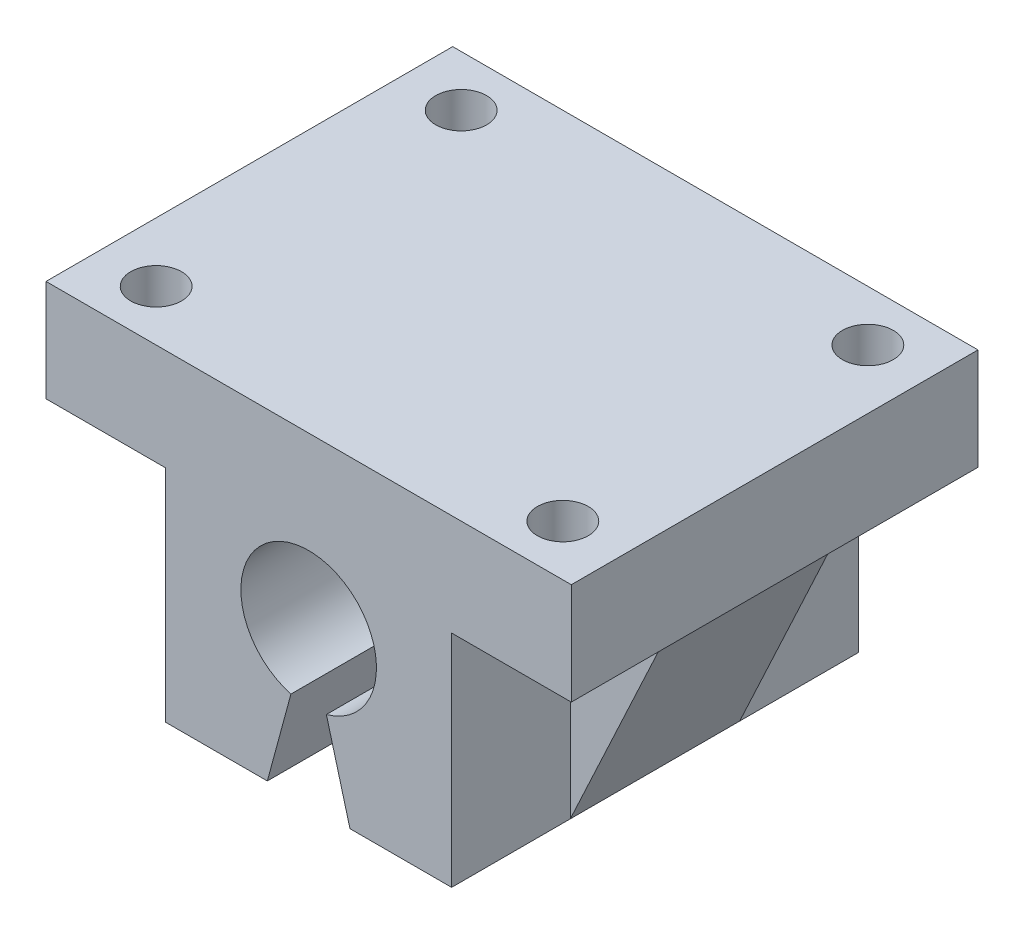
ISO-10303-21;
HEADER;
FILE_DESCRIPTION(('STEP AP214'),'2;1');
FILE_NAME('part.step','',(''),(''),'','','');
FILE_SCHEMA(('AUTOMOTIVE_DESIGN { 1 0 10303 214 1 1 1 1 }'));
ENDSEC;
DATA;
#1=APPLICATION_CONTEXT('core data for automotive mechanical design processes');
#2=APPLICATION_PROTOCOL_DEFINITION('international standard','automotive_design',2000,#1);
#3=PRODUCT_CONTEXT('',#1,'mechanical');
#4=PRODUCT('Part','Part','',(#3));
#5=PRODUCT_RELATED_PRODUCT_CATEGORY('part','',(#4));
#6=PRODUCT_DEFINITION_FORMATION('','',#4);
#7=PRODUCT_DEFINITION_CONTEXT('part definition',#1,'design');
#8=PRODUCT_DEFINITION('design','',#6,#7);
#9=PRODUCT_DEFINITION_SHAPE('','',#8);
#10=(LENGTH_UNIT() NAMED_UNIT(*) SI_UNIT(.MILLI.,.METRE.));
#11=(NAMED_UNIT(*) PLANE_ANGLE_UNIT() SI_UNIT($,.RADIAN.));
#12=(NAMED_UNIT(*) SI_UNIT($,.STERADIAN.) SOLID_ANGLE_UNIT());
#13=UNCERTAINTY_MEASURE_WITH_UNIT(LENGTH_MEASURE(1.E-05),#10,'distance_accuracy_value','');
#14=(GEOMETRIC_REPRESENTATION_CONTEXT(3) GLOBAL_UNCERTAINTY_ASSIGNED_CONTEXT((#13)) GLOBAL_UNIT_ASSIGNED_CONTEXT((#10,
#11,#12)) REPRESENTATION_CONTEXT('',''));
#15=CARTESIAN_POINT('',(0.,0.,0.));
#16=DIRECTION('',(0.,0.,1.));
#17=DIRECTION('',(1.,0.,0.));
#18=AXIS2_PLACEMENT_3D('',#15,#16,#17);
#19=CARTESIAN_POINT('',(0.,-6.,12.));
#20=DIRECTION('',(0.,1.,0.));
#21=DIRECTION('',(0.,0.,1.));
#22=AXIS2_PLACEMENT_3D('',#19,#20,#21);
#23=PLANE('',#22);
#24=CARTESIAN_POINT('',(-12.,-6.,9.));
#25=DIRECTION('',(0.,1.,0.));
#26=DIRECTION('',(0.,0.,1.));
#27=AXIS2_PLACEMENT_3D('',#24,#25,#26);
#28=CIRCLE('',#27,1.5);
#29=CARTESIAN_POINT('',(-12.,-6.,10.5));
#30=VERTEX_POINT('',#29);
#31=EDGE_CURVE('E580',#30,#30,#28,.F.);
#32=ORIENTED_EDGE('',*,*,#31,.F.);
#33=EDGE_LOOP('',(#32));
#34=FACE_BOUND('',#33,.T.);
#35=CARTESIAN_POINT('',(-12.,-6.,-9.));
#36=DIRECTION('',(0.,1.,0.));
#37=DIRECTION('',(0.,0.,1.));
#38=AXIS2_PLACEMENT_3D('',#35,#36,#37);
#39=CIRCLE('',#38,1.5);
#40=CARTESIAN_POINT('',(-12.,-6.,-7.5));
#41=VERTEX_POINT('',#40);
#42=EDGE_CURVE('E592',#41,#41,#39,.F.);
#43=ORIENTED_EDGE('',*,*,#42,.F.);
#44=EDGE_LOOP('',(#43));
#45=FACE_BOUND('',#44,.T.);
#46=DIRECTION('',(-1.,0.,0.));
#47=VECTOR('',#46,1.);
#48=CARTESIAN_POINT('',(-14.5,-6.,5.));
#49=LINE('',#48,#47);
#50=CARTESIAN_POINT('',(-8.43800044398506,-6.,5.));
#51=VERTEX_POINT('',#50);
#52=CARTESIAN_POINT('',(-14.5,-6.,5.));
#53=VERTEX_POINT('',#52);
#54=EDGE_CURVE('E170',#51,#53,#49,.T.);
#55=ORIENTED_EDGE('',*,*,#54,.F.);
#56=DIRECTION('',(0.,0.,-1.));
#57=VECTOR('',#56,1.);
#58=CARTESIAN_POINT('',(-8.43800044398506,-6.,12.));
#59=LINE('',#58,#57);
#60=CARTESIAN_POINT('',(-8.43800044398506,-6.,12.));
#61=VERTEX_POINT('',#60);
#62=EDGE_CURVE('E267',#61,#51,#59,.T.);
#63=ORIENTED_EDGE('',*,*,#62,.F.);
#64=DIRECTION('',(1.,0.,0.));
#65=VECTOR('',#64,1.);
#66=CARTESIAN_POINT('',(0.,-6.,12.));
#67=LINE('',#66,#65);
#68=CARTESIAN_POINT('',(-15.5,-6.,12.));
#69=VERTEX_POINT('',#68);
#70=EDGE_CURVE('E221',#69,#61,#67,.T.);
#71=ORIENTED_EDGE('',*,*,#70,.F.);
#72=DIRECTION('',(0.,0.,-1.));
#73=VECTOR('',#72,1.);
#74=CARTESIAN_POINT('',(-15.5,-6.,12.));
#75=LINE('',#74,#73);
#76=CARTESIAN_POINT('',(-15.5,-6.,-12.));
#77=VERTEX_POINT('',#76);
#78=EDGE_CURVE('E269',#69,#77,#75,.T.);
#79=ORIENTED_EDGE('',*,*,#78,.T.);
#80=DIRECTION('',(1.,0.,0.));
#81=VECTOR('',#80,1.);
#82=CARTESIAN_POINT('',(0.,-6.,-12.));
#83=LINE('',#82,#81);
#84=CARTESIAN_POINT('',(-8.43800044398506,-6.,-12.));
#85=VERTEX_POINT('',#84);
#86=EDGE_CURVE('E248',#77,#85,#83,.T.);
#87=ORIENTED_EDGE('',*,*,#86,.T.);
#88=CARTESIAN_POINT('',(-8.43800044398506,-6.,-5.));
#89=VERTEX_POINT('',#88);
#90=EDGE_CURVE('E266',#89,#85,#59,.T.);
#91=ORIENTED_EDGE('',*,*,#90,.F.);
#92=DIRECTION('',(-1.,0.,0.));
#93=VECTOR('',#92,1.);
#94=CARTESIAN_POINT('',(-14.5,-6.,-5.));
#95=LINE('',#94,#93);
#96=CARTESIAN_POINT('',(-14.5,-6.,-5.));
#97=VERTEX_POINT('',#96);
#98=EDGE_CURVE('E179',#89,#97,#95,.T.);
#99=ORIENTED_EDGE('',*,*,#98,.T.);
#100=DIRECTION('',(0.,0.,-1.));
#101=VECTOR('',#100,1.);
#102=CARTESIAN_POINT('',(-14.5,-6.,5.));
#103=LINE('',#102,#101);
#104=EDGE_CURVE('E163',#53,#97,#103,.T.);
#105=ORIENTED_EDGE('',*,*,#104,.F.);
#106=EDGE_LOOP('',(#55,#63,#71,#79,#87,#91,#99,#105));
#107=FACE_BOUND('',#106,.T.);
#108=ADVANCED_FACE('F34',(#34,#45,#107),#23,.F.);
#109=CARTESIAN_POINT('',(-8.43800044398506,0.,12.));
#110=DIRECTION('',(1.,0.,0.));
#111=DIRECTION('',(0.,1.,0.));
#112=AXIS2_PLACEMENT_3D('',#109,#110,#111);
#113=PLANE('',#112);
#114=DIRECTION('',(0.,1.,0.));
#115=VECTOR('',#114,1.);
#116=CARTESIAN_POINT('',(-8.43800044398506,-6.,5.));
#117=LINE('',#116,#115);
#118=CARTESIAN_POINT('',(-8.43800044398506,-19.,5.));
#119=VERTEX_POINT('',#118);
#120=EDGE_CURVE('E169',#119,#51,#117,.T.);
#121=ORIENTED_EDGE('',*,*,#120,.F.);
#122=DIRECTION('',(0.,0.,-1.));
#123=VECTOR('',#122,1.);
#124=CARTESIAN_POINT('',(-8.43800044398506,-19.,12.));
#125=LINE('',#124,#123);
#126=CARTESIAN_POINT('',(-8.43800044398506,-19.,12.));
#127=VERTEX_POINT('',#126);
#128=EDGE_CURVE('E263',#127,#119,#125,.T.);
#129=ORIENTED_EDGE('',*,*,#128,.F.);
#130=DIRECTION('',(0.,-1.,0.));
#131=VECTOR('',#130,1.);
#132=CARTESIAN_POINT('',(-8.43800044398506,0.,12.));
#133=LINE('',#132,#131);
#134=EDGE_CURVE('E223',#61,#127,#133,.T.);
#135=ORIENTED_EDGE('',*,*,#134,.F.);
#136=ORIENTED_EDGE('',*,*,#62,.T.);
#137=EDGE_LOOP('',(#121,#129,#135,#136));
#138=FACE_BOUND('',#137,.T.);
#139=ADVANCED_FACE('F370',(#138),#113,.F.);
#140=CARTESIAN_POINT('',(8.43800044398507,0.,12.));
#141=DIRECTION('',(-1.,0.,0.));
#142=DIRECTION('',(0.,0.,1.));
#143=AXIS2_PLACEMENT_3D('',#140,#141,#142);
#144=PLANE('',#143);
#145=DIRECTION('',(0.,-1.,0.));
#146=VECTOR('',#145,1.);
#147=CARTESIAN_POINT('',(8.43800044398507,-19.,5.));
#148=LINE('',#147,#146);
#149=CARTESIAN_POINT('',(8.43800044398507,-6.,5.));
#150=VERTEX_POINT('',#149);
#151=CARTESIAN_POINT('',(8.43800044398507,-19.,5.));
#152=VERTEX_POINT('',#151);
#153=EDGE_CURVE('E186',#150,#152,#148,.T.);
#154=ORIENTED_EDGE('',*,*,#153,.F.);
#155=DIRECTION('',(0.,0.,-1.));
#156=VECTOR('',#155,1.);
#157=CARTESIAN_POINT('',(8.43800044398507,-6.,12.));
#158=LINE('',#157,#156);
#159=CARTESIAN_POINT('',(8.43800044398507,-6.,12.));
#160=VERTEX_POINT('',#159);
#161=EDGE_CURVE('E282',#160,#150,#158,.T.);
#162=ORIENTED_EDGE('',*,*,#161,.F.);
#163=DIRECTION('',(0.,1.,0.));
#164=VECTOR('',#163,1.);
#165=CARTESIAN_POINT('',(8.43800044398507,0.,12.));
#166=LINE('',#165,#164);
#167=CARTESIAN_POINT('',(8.43800044398507,-19.,12.));
#168=VERTEX_POINT('',#167);
#169=EDGE_CURVE('E211',#168,#160,#166,.T.);
#170=ORIENTED_EDGE('',*,*,#169,.F.);
#171=DIRECTION('',(0.,0.,-1.));
#172=VECTOR('',#171,1.);
#173=CARTESIAN_POINT('',(8.43800044398507,-19.,12.));
#174=LINE('',#173,#172);
#175=EDGE_CURVE('E286',#168,#152,#174,.T.);
#176=ORIENTED_EDGE('',*,*,#175,.T.);
#177=EDGE_LOOP('',(#154,#162,#170,#176));
#178=FACE_BOUND('',#177,.T.);
#179=ADVANCED_FACE('F313',(#178),#144,.F.);
#180=CARTESIAN_POINT('',(0.,-6.,12.));
#181=DIRECTION('',(0.,1.,0.));
#182=DIRECTION('',(0.,0.,1.));
#183=AXIS2_PLACEMENT_3D('',#180,#181,#182);
#184=PLANE('',#183);
#185=CARTESIAN_POINT('',(12.,-6.,9.));
#186=DIRECTION('',(0.,1.,0.));
#187=DIRECTION('',(0.,0.,1.));
#188=AXIS2_PLACEMENT_3D('',#185,#186,#187);
#189=CIRCLE('',#188,1.5);
#190=CARTESIAN_POINT('',(12.,-6.,10.5));
#191=VERTEX_POINT('',#190);
#192=EDGE_CURVE('E584',#191,#191,#189,.F.);
#193=ORIENTED_EDGE('',*,*,#192,.F.);
#194=EDGE_LOOP('',(#193));
#195=FACE_BOUND('',#194,.T.);
#196=CARTESIAN_POINT('',(12.,-6.,-9.));
#197=DIRECTION('',(0.,1.,0.));
#198=DIRECTION('',(0.,0.,1.));
#199=AXIS2_PLACEMENT_3D('',#196,#197,#198);
#200=CIRCLE('',#199,1.5);
#201=CARTESIAN_POINT('',(12.,-6.,-7.5));
#202=VERTEX_POINT('',#201);
#203=EDGE_CURVE('E593',#202,#202,#200,.F.);
#204=ORIENTED_EDGE('',*,*,#203,.F.);
#205=EDGE_LOOP('',(#204));
#206=FACE_BOUND('',#205,.T.);
#207=DIRECTION('',(-1.,0.,0.));
#208=VECTOR('',#207,1.);
#209=CARTESIAN_POINT('',(8.43800044398507,-6.,5.));
#210=LINE('',#209,#208);
#211=CARTESIAN_POINT('',(14.5,-6.,5.));
#212=VERTEX_POINT('',#211);
#213=EDGE_CURVE('E192',#212,#150,#210,.T.);
#214=ORIENTED_EDGE('',*,*,#213,.F.);
#215=DIRECTION('',(0.,0.,-1.));
#216=VECTOR('',#215,1.);
#217=CARTESIAN_POINT('',(14.5,-6.,5.));
#218=LINE('',#217,#216);
#219=CARTESIAN_POINT('',(14.5,-6.,-5.));
#220=VERTEX_POINT('',#219);
#221=EDGE_CURVE('E193',#212,#220,#218,.T.);
#222=ORIENTED_EDGE('',*,*,#221,.T.);
#223=DIRECTION('',(-1.,0.,0.));
#224=VECTOR('',#223,1.);
#225=CARTESIAN_POINT('',(8.43800044398507,-6.,-5.));
#226=LINE('',#225,#224);
#227=CARTESIAN_POINT('',(8.43800044398507,-6.,-5.));
#228=VERTEX_POINT('',#227);
#229=EDGE_CURVE('E190',#220,#228,#226,.T.);
#230=ORIENTED_EDGE('',*,*,#229,.T.);
#231=CARTESIAN_POINT('',(8.43800044398507,-6.,-12.));
#232=VERTEX_POINT('',#231);
#233=EDGE_CURVE('E281',#228,#232,#158,.T.);
#234=ORIENTED_EDGE('',*,*,#233,.T.);
#235=DIRECTION('',(1.,0.,0.));
#236=VECTOR('',#235,1.);
#237=CARTESIAN_POINT('',(0.,-6.,-12.));
#238=LINE('',#237,#236);
#239=CARTESIAN_POINT('',(15.5,-5.99999999999999,-12.));
#240=VERTEX_POINT('',#239);
#241=EDGE_CURVE('E240',#232,#240,#238,.T.);
#242=ORIENTED_EDGE('',*,*,#241,.T.);
#243=DIRECTION('',(0.,0.,-1.));
#244=VECTOR('',#243,1.);
#245=CARTESIAN_POINT('',(15.5,-5.99999999999999,12.));
#246=LINE('',#245,#244);
#247=CARTESIAN_POINT('',(15.5,-5.99999999999999,12.));
#248=VERTEX_POINT('',#247);
#249=EDGE_CURVE('E278',#248,#240,#246,.T.);
#250=ORIENTED_EDGE('',*,*,#249,.F.);
#251=DIRECTION('',(1.,0.,0.));
#252=VECTOR('',#251,1.);
#253=CARTESIAN_POINT('',(0.,-6.,12.));
#254=LINE('',#253,#252);
#255=EDGE_CURVE('E213',#160,#248,#254,.T.);
#256=ORIENTED_EDGE('',*,*,#255,.F.);
#257=ORIENTED_EDGE('',*,*,#161,.T.);
#258=EDGE_LOOP('',(#214,#222,#230,#234,#242,#250,#256,#257));
#259=FACE_BOUND('',#258,.T.);
#260=ADVANCED_FACE('F354',(#195,#206,#259),#184,.F.);
#261=CARTESIAN_POINT('',(0.,-10.,12.));
#262=DIRECTION('',(0.,0.,-1.));
#263=DIRECTION('',(-1.,0.,0.));
#264=AXIS2_PLACEMENT_3D('',#261,#262,#263);
#265=CYLINDRICAL_SURFACE('',#264,4.);
#266=CARTESIAN_POINT('',(0.,-10.,-12.));
#267=DIRECTION('',(0.,0.,1.));
#268=DIRECTION('',(1.,0.,0.));
#269=AXIS2_PLACEMENT_3D('',#266,#267,#268);
#270=CIRCLE('',#269,4.);
#271=CARTESIAN_POINT('',(1.04586191274877,-13.8608513127886,-12.));
#272=VERTEX_POINT('',#271);
#273=CARTESIAN_POINT('',(-1.04586191274877,-13.8608513127886,-12.));
#274=VERTEX_POINT('',#273);
#275=EDGE_CURVE('E202',#272,#274,#270,.T.);
#276=ORIENTED_EDGE('',*,*,#275,.F.);
#277=DIRECTION('',(0.,0.,-1.));
#278=VECTOR('',#277,1.);
#279=CARTESIAN_POINT('',(1.04586191274877,-13.8608513127886,12.));
#280=LINE('',#279,#278);
#281=CARTESIAN_POINT('',(1.04586191274877,-13.8608513127886,12.));
#282=VERTEX_POINT('',#281);
#283=EDGE_CURVE('E11',#282,#272,#280,.T.);
#284=ORIENTED_EDGE('',*,*,#283,.F.);
#285=CARTESIAN_POINT('',(0.,-10.,12.));
#286=DIRECTION('',(0.,0.,1.));
#287=DIRECTION('',(1.,0.,0.));
#288=AXIS2_PLACEMENT_3D('',#285,#286,#287);
#289=CIRCLE('',#288,4.);
#290=CARTESIAN_POINT('',(-1.04586191274877,-13.8608513127886,12.));
#291=VERTEX_POINT('',#290);
#292=EDGE_CURVE('E203',#282,#291,#289,.T.);
#293=ORIENTED_EDGE('',*,*,#292,.T.);
#294=DIRECTION('',(0.,0.,-1.));
#295=VECTOR('',#294,1.);
#296=CARTESIAN_POINT('',(-1.04586191274877,-13.8608513127886,12.));
#297=LINE('',#296,#295);
#298=EDGE_CURVE('E229',#291,#274,#297,.T.);
#299=ORIENTED_EDGE('',*,*,#298,.T.);
#300=EDGE_LOOP('',(#276,#284,#293,#299));
#301=FACE_BOUND('',#300,.T.);
#302=ADVANCED_FACE('F36',(#301),#265,.F.);
#303=CARTESIAN_POINT('',(-2.52369833676981,-0.683641962836577,12.));
#304=DIRECTION('',(0.965212828197151,0.261465478187193,0.));
#305=DIRECTION('',(-0.261465478187193,0.965212828197151,0.));
#306=AXIS2_PLACEMENT_3D('',#303,#304,#305);
#307=PLANE('',#306);
#308=DIRECTION('',(0.261465478187193,-0.965212828197151,0.));
#309=VECTOR('',#308,1.);
#310=CARTESIAN_POINT('',(-2.52369833676981,-0.683641962836577,-12.));
#311=LINE('',#310,#309);
#312=CARTESIAN_POINT('',(2.43800044398507,-19.,-12.));
#313=VERTEX_POINT('',#312);
#314=EDGE_CURVE('E232',#272,#313,#311,.T.);
#315=ORIENTED_EDGE('',*,*,#314,.T.);
#316=DIRECTION('',(0.,0.,-1.));
#317=VECTOR('',#316,1.);
#318=CARTESIAN_POINT('',(2.43800044398507,-19.,12.));
#319=LINE('',#318,#317);
#320=CARTESIAN_POINT('',(2.43800044398507,-19.,12.));
#321=VERTEX_POINT('',#320);
#322=EDGE_CURVE('E42',#321,#313,#319,.T.);
#323=ORIENTED_EDGE('',*,*,#322,.F.);
#324=DIRECTION('',(0.261465478187193,-0.965212828197151,0.));
#325=VECTOR('',#324,1.);
#326=CARTESIAN_POINT('',(-2.52369833676981,-0.683641962836577,12.));
#327=LINE('',#326,#325);
#328=EDGE_CURVE('E206',#282,#321,#327,.T.);
#329=ORIENTED_EDGE('',*,*,#328,.F.);
#330=ORIENTED_EDGE('',*,*,#283,.T.);
#331=EDGE_LOOP('',(#315,#323,#329,#330));
#332=FACE_BOUND('',#331,.T.);
#333=ADVANCED_FACE('F320',(#332),#307,.F.);
#334=CARTESIAN_POINT('',(0.,-19.,12.));
#335=DIRECTION('',(0.,1.,0.));
#336=DIRECTION('',(-1.,0.,0.));
#337=AXIS2_PLACEMENT_3D('',#334,#335,#336);
#338=PLANE('',#337);
#339=DIRECTION('',(1.,0.,0.));
#340=VECTOR('',#339,1.);
#341=CARTESIAN_POINT('',(0.,-19.,-12.));
#342=LINE('',#341,#340);
#343=CARTESIAN_POINT('',(8.43800044398507,-19.,-12.));
#344=VERTEX_POINT('',#343);
#345=EDGE_CURVE('E234',#313,#344,#342,.T.);
#346=ORIENTED_EDGE('',*,*,#345,.T.);
#347=CARTESIAN_POINT('',(8.43800044398507,-19.,-5.));
#348=VERTEX_POINT('',#347);
#349=EDGE_CURVE('E285',#348,#344,#174,.T.);
#350=ORIENTED_EDGE('',*,*,#349,.F.);
#351=DIRECTION('',(0.,0.,-1.));
#352=VECTOR('',#351,1.);
#353=CARTESIAN_POINT('',(8.43800044398507,-19.,5.));
#354=LINE('',#353,#352);
#355=EDGE_CURVE('E199',#152,#348,#354,.T.);
#356=ORIENTED_EDGE('',*,*,#355,.F.);
#357=ORIENTED_EDGE('',*,*,#175,.F.);
#358=DIRECTION('',(1.,0.,0.));
#359=VECTOR('',#358,1.);
#360=CARTESIAN_POINT('',(0.,-19.,12.));
#361=LINE('',#360,#359);
#362=EDGE_CURVE('E209',#321,#168,#361,.T.);
#363=ORIENTED_EDGE('',*,*,#362,.F.);
#364=ORIENTED_EDGE('',*,*,#322,.T.);
#365=EDGE_LOOP('',(#346,#350,#356,#357,#363,#364));
#366=FACE_BOUND('',#365,.T.);
#367=ADVANCED_FACE('F293',(#366),#338,.F.);
#368=ORIENTED_EDGE('',*,*,#233,.F.);
#369=DIRECTION('',(0.,-1.,0.));
#370=VECTOR('',#369,1.);
#371=CARTESIAN_POINT('',(8.43800044398507,-19.,-5.));
#372=LINE('',#371,#370);
#373=EDGE_CURVE('E57',#228,#348,#372,.T.);
#374=ORIENTED_EDGE('',*,*,#373,.T.);
#375=ORIENTED_EDGE('',*,*,#349,.T.);
#376=DIRECTION('',(0.,1.,0.));
#377=VECTOR('',#376,1.);
#378=CARTESIAN_POINT('',(8.43800044398507,0.,-12.));
#379=LINE('',#378,#377);
#380=EDGE_CURVE('E237',#344,#232,#379,.T.);
#381=ORIENTED_EDGE('',*,*,#380,.T.);
#382=EDGE_LOOP('',(#368,#374,#375,#381));
#383=FACE_BOUND('',#382,.T.);
#384=ADVANCED_FACE('F307',(#383),#144,.F.);
#385=CARTESIAN_POINT('',(15.5,0.,12.));
#386=DIRECTION('',(-1.,0.,0.));
#387=DIRECTION('',(0.,0.,1.));
#388=AXIS2_PLACEMENT_3D('',#385,#386,#387);
#389=PLANE('',#388);
#390=DIRECTION('',(0.,1.,0.));
#391=VECTOR('',#390,1.);
#392=CARTESIAN_POINT('',(15.5,0.,-12.));
#393=LINE('',#392,#391);
#394=CARTESIAN_POINT('',(15.5,0.,-12.));
#395=VERTEX_POINT('',#394);
#396=EDGE_CURVE('E242',#240,#395,#393,.T.);
#397=ORIENTED_EDGE('',*,*,#396,.T.);
#398=DIRECTION('',(0.,0.,-1.));
#399=VECTOR('',#398,1.);
#400=CARTESIAN_POINT('',(15.5,0.,12.));
#401=LINE('',#400,#399);
#402=CARTESIAN_POINT('',(15.5,0.,12.));
#403=VERTEX_POINT('',#402);
#404=EDGE_CURVE('E275',#403,#395,#401,.T.);
#405=ORIENTED_EDGE('',*,*,#404,.F.);
#406=DIRECTION('',(0.,1.,0.));
#407=VECTOR('',#406,1.);
#408=CARTESIAN_POINT('',(15.5,0.,12.));
#409=LINE('',#408,#407);
#410=EDGE_CURVE('E215',#248,#403,#409,.T.);
#411=ORIENTED_EDGE('',*,*,#410,.F.);
#412=ORIENTED_EDGE('',*,*,#249,.T.);
#413=EDGE_LOOP('',(#397,#405,#411,#412));
#414=FACE_BOUND('',#413,.T.);
#415=ADVANCED_FACE('F350',(#414),#389,.F.);
#416=CARTESIAN_POINT('',(0.,0.,12.));
#417=DIRECTION('',(0.,-1.,0.));
#418=DIRECTION('',(0.,0.,-1.));
#419=AXIS2_PLACEMENT_3D('',#416,#417,#418);
#420=PLANE('',#419);
#421=CARTESIAN_POINT('',(-12.,0.,9.));
#422=DIRECTION('',(0.,1.,0.));
#423=DIRECTION('',(0.,0.,1.));
#424=AXIS2_PLACEMENT_3D('',#421,#422,#423);
#425=CIRCLE('',#424,1.5);
#426=CARTESIAN_POINT('',(-12.,0.,10.5));
#427=VERTEX_POINT('',#426);
#428=EDGE_CURVE('E578',#427,#427,#425,.T.);
#429=ORIENTED_EDGE('',*,*,#428,.F.);
#430=EDGE_LOOP('',(#429));
#431=FACE_BOUND('',#430,.T.);
#432=CARTESIAN_POINT('',(12.,0.,9.));
#433=DIRECTION('',(0.,1.,0.));
#434=DIRECTION('',(0.,0.,1.));
#435=AXIS2_PLACEMENT_3D('',#432,#433,#434);
#436=CIRCLE('',#435,1.5);
#437=CARTESIAN_POINT('',(12.,0.,10.5));
#438=VERTEX_POINT('',#437);
#439=EDGE_CURVE('E581',#438,#438,#436,.T.);
#440=ORIENTED_EDGE('',*,*,#439,.F.);
#441=EDGE_LOOP('',(#440));
#442=FACE_BOUND('',#441,.T.);
#443=CARTESIAN_POINT('',(12.,0.,-9.));
#444=DIRECTION('',(0.,1.,0.));
#445=DIRECTION('',(0.,0.,1.));
#446=AXIS2_PLACEMENT_3D('',#443,#444,#445);
#447=CIRCLE('',#446,1.5);
#448=CARTESIAN_POINT('',(12.,0.,-7.5));
#449=VERTEX_POINT('',#448);
#450=EDGE_CURVE('E603',#449,#449,#447,.T.);
#451=ORIENTED_EDGE('',*,*,#450,.F.);
#452=EDGE_LOOP('',(#451));
#453=FACE_BOUND('',#452,.T.);
#454=CARTESIAN_POINT('',(-12.,0.,-9.));
#455=DIRECTION('',(0.,1.,0.));
#456=DIRECTION('',(0.,0.,1.));
#457=AXIS2_PLACEMENT_3D('',#454,#455,#456);
#458=CIRCLE('',#457,1.5);
#459=CARTESIAN_POINT('',(-12.,0.,-7.5));
#460=VERTEX_POINT('',#459);
#461=EDGE_CURVE('E589',#460,#460,#458,.T.);
#462=ORIENTED_EDGE('',*,*,#461,.F.);
#463=EDGE_LOOP('',(#462));
#464=FACE_BOUND('',#463,.T.);
#465=DIRECTION('',(-1.,0.,0.));
#466=VECTOR('',#465,1.);
#467=CARTESIAN_POINT('',(0.,0.,-12.));
#468=LINE('',#467,#466);
#469=CARTESIAN_POINT('',(-15.5,0.,-12.));
#470=VERTEX_POINT('',#469);
#471=EDGE_CURVE('E244',#395,#470,#468,.T.);
#472=ORIENTED_EDGE('',*,*,#471,.T.);
#473=DIRECTION('',(0.,0.,-1.));
#474=VECTOR('',#473,1.);
#475=CARTESIAN_POINT('',(-15.5,0.,12.));
#476=LINE('',#475,#474);
#477=CARTESIAN_POINT('',(-15.5,0.,12.));
#478=VERTEX_POINT('',#477);
#479=EDGE_CURVE('E272',#478,#470,#476,.T.);
#480=ORIENTED_EDGE('',*,*,#479,.F.);
#481=DIRECTION('',(-1.,0.,0.));
#482=VECTOR('',#481,1.);
#483=CARTESIAN_POINT('',(0.,0.,12.));
#484=LINE('',#483,#482);
#485=EDGE_CURVE('E217',#403,#478,#484,.T.);
#486=ORIENTED_EDGE('',*,*,#485,.F.);
#487=ORIENTED_EDGE('',*,*,#404,.T.);
#488=EDGE_LOOP('',(#472,#480,#486,#487));
#489=FACE_BOUND('',#488,.T.);
#490=ADVANCED_FACE('F347',(#431,#442,#453,#464,#489),#420,.F.);
#491=CARTESIAN_POINT('',(-15.5,0.,12.));
#492=DIRECTION('',(1.,0.,0.));
#493=DIRECTION('',(0.,0.,-1.));
#494=AXIS2_PLACEMENT_3D('',#491,#492,#493);
#495=PLANE('',#494);
#496=DIRECTION('',(0.,-1.,0.));
#497=VECTOR('',#496,1.);
#498=CARTESIAN_POINT('',(-15.5,0.,-12.));
#499=LINE('',#498,#497);
#500=EDGE_CURVE('E246',#470,#77,#499,.T.);
#501=ORIENTED_EDGE('',*,*,#500,.T.);
#502=ORIENTED_EDGE('',*,*,#78,.F.);
#503=DIRECTION('',(0.,-1.,0.));
#504=VECTOR('',#503,1.);
#505=CARTESIAN_POINT('',(-15.5,0.,12.));
#506=LINE('',#505,#504);
#507=EDGE_CURVE('E219',#478,#69,#506,.T.);
#508=ORIENTED_EDGE('',*,*,#507,.F.);
#509=ORIENTED_EDGE('',*,*,#479,.T.);
#510=EDGE_LOOP('',(#501,#502,#508,#509));
#511=FACE_BOUND('',#510,.T.);
#512=ADVANCED_FACE('F343',(#511),#495,.F.);
#513=CARTESIAN_POINT('',(-8.43800044398506,-19.,-5.));
#514=VERTEX_POINT('',#513);
#515=CARTESIAN_POINT('',(-8.43800044398506,-19.,-12.));
#516=VERTEX_POINT('',#515);
#517=EDGE_CURVE('E262',#514,#516,#125,.T.);
#518=ORIENTED_EDGE('',*,*,#517,.F.);
#519=DIRECTION('',(0.,1.,0.));
#520=VECTOR('',#519,1.);
#521=CARTESIAN_POINT('',(-8.43800044398506,-6.,-5.));
#522=LINE('',#521,#520);
#523=EDGE_CURVE('E49',#514,#89,#522,.T.);
#524=ORIENTED_EDGE('',*,*,#523,.T.);
#525=ORIENTED_EDGE('',*,*,#90,.T.);
#526=DIRECTION('',(0.,-1.,0.));
#527=VECTOR('',#526,1.);
#528=CARTESIAN_POINT('',(-8.43800044398506,0.,-12.));
#529=LINE('',#528,#527);
#530=EDGE_CURVE('E251',#85,#516,#529,.T.);
#531=ORIENTED_EDGE('',*,*,#530,.T.);
#532=EDGE_LOOP('',(#518,#524,#525,#531));
#533=FACE_BOUND('',#532,.T.);
#534=ADVANCED_FACE('F335',(#533),#113,.F.);
#535=CARTESIAN_POINT('',(0.,-19.,12.));
#536=DIRECTION('',(0.,1.,0.));
#537=DIRECTION('',(0.,0.,1.));
#538=AXIS2_PLACEMENT_3D('',#535,#536,#537);
#539=PLANE('',#538);
#540=DIRECTION('',(1.,0.,0.));
#541=VECTOR('',#540,1.);
#542=CARTESIAN_POINT('',(0.,-19.,-12.));
#543=LINE('',#542,#541);
#544=CARTESIAN_POINT('',(-2.43800044398506,-19.,-12.));
#545=VERTEX_POINT('',#544);
#546=EDGE_CURVE('E254',#516,#545,#543,.T.);
#547=ORIENTED_EDGE('',*,*,#546,.T.);
#548=DIRECTION('',(0.,0.,-1.));
#549=VECTOR('',#548,1.);
#550=CARTESIAN_POINT('',(-2.43800044398506,-19.,12.));
#551=LINE('',#550,#549);
#552=CARTESIAN_POINT('',(-2.43800044398506,-19.,12.));
#553=VERTEX_POINT('',#552);
#554=EDGE_CURVE('E259',#553,#545,#551,.T.);
#555=ORIENTED_EDGE('',*,*,#554,.F.);
#556=DIRECTION('',(1.,0.,0.));
#557=VECTOR('',#556,1.);
#558=CARTESIAN_POINT('',(0.,-19.,12.));
#559=LINE('',#558,#557);
#560=EDGE_CURVE('E225',#127,#553,#559,.T.);
#561=ORIENTED_EDGE('',*,*,#560,.F.);
#562=ORIENTED_EDGE('',*,*,#128,.T.);
#563=DIRECTION('',(0.,0.,-1.));
#564=VECTOR('',#563,1.);
#565=CARTESIAN_POINT('',(-8.43800044398506,-19.,5.));
#566=LINE('',#565,#564);
#567=EDGE_CURVE('E166',#119,#514,#566,.T.);
#568=ORIENTED_EDGE('',*,*,#567,.T.);
#569=ORIENTED_EDGE('',*,*,#517,.T.);
#570=EDGE_LOOP('',(#547,#555,#561,#562,#568,#569));
#571=FACE_BOUND('',#570,.T.);
#572=ADVANCED_FACE('F332',(#571),#539,.F.);
#573=CARTESIAN_POINT('',(2.52369833676981,-0.683641962836573,12.));
#574=DIRECTION('',(-0.965212828197151,0.261465478187193,0.));
#575=DIRECTION('',(-0.261465478187193,-0.965212828197151,0.));
#576=AXIS2_PLACEMENT_3D('',#573,#574,#575);
#577=PLANE('',#576);
#578=DIRECTION('',(0.261465478187193,0.965212828197151,0.));
#579=VECTOR('',#578,1.);
#580=CARTESIAN_POINT('',(2.52369833676981,-0.683641962836573,-12.));
#581=LINE('',#580,#579);
#582=EDGE_CURVE('E207',#545,#274,#581,.T.);
#583=ORIENTED_EDGE('',*,*,#582,.T.);
#584=ORIENTED_EDGE('',*,*,#298,.F.);
#585=DIRECTION('',(0.261465478187193,0.965212828197151,0.));
#586=VECTOR('',#585,1.);
#587=CARTESIAN_POINT('',(2.52369833676981,-0.683641962836573,12.));
#588=LINE('',#587,#586);
#589=EDGE_CURVE('E227',#553,#291,#588,.T.);
#590=ORIENTED_EDGE('',*,*,#589,.F.);
#591=ORIENTED_EDGE('',*,*,#554,.T.);
#592=EDGE_LOOP('',(#583,#584,#590,#591));
#593=FACE_BOUND('',#592,.T.);
#594=ADVANCED_FACE('F327',(#593),#577,.F.);
#595=CARTESIAN_POINT('',(0.,0.,12.));
#596=DIRECTION('',(0.,0.,1.));
#597=DIRECTION('',(1.,0.,0.));
#598=AXIS2_PLACEMENT_3D('',#595,#596,#597);
#599=PLANE('',#598);
#600=ORIENTED_EDGE('',*,*,#292,.F.);
#601=ORIENTED_EDGE('',*,*,#328,.T.);
#602=ORIENTED_EDGE('',*,*,#362,.T.);
#603=ORIENTED_EDGE('',*,*,#169,.T.);
#604=ORIENTED_EDGE('',*,*,#255,.T.);
#605=ORIENTED_EDGE('',*,*,#410,.T.);
#606=ORIENTED_EDGE('',*,*,#485,.T.);
#607=ORIENTED_EDGE('',*,*,#507,.T.);
#608=ORIENTED_EDGE('',*,*,#70,.T.);
#609=ORIENTED_EDGE('',*,*,#134,.T.);
#610=ORIENTED_EDGE('',*,*,#560,.T.);
#611=ORIENTED_EDGE('',*,*,#589,.T.);
#612=EDGE_LOOP('',(#600,#601,#602,#603,#604,#605,#606,#607,#608,#609,#610,#611));
#613=FACE_BOUND('',#612,.T.);
#614=ADVANCED_FACE('F318',(#613),#599,.T.);
#615=CARTESIAN_POINT('',(0.,0.,-12.));
#616=DIRECTION('',(0.,0.,1.));
#617=DIRECTION('',(1.,0.,0.));
#618=AXIS2_PLACEMENT_3D('',#615,#616,#617);
#619=PLANE('',#618);
#620=ORIENTED_EDGE('',*,*,#275,.T.);
#621=ORIENTED_EDGE('',*,*,#582,.F.);
#622=ORIENTED_EDGE('',*,*,#546,.F.);
#623=ORIENTED_EDGE('',*,*,#530,.F.);
#624=ORIENTED_EDGE('',*,*,#86,.F.);
#625=ORIENTED_EDGE('',*,*,#500,.F.);
#626=ORIENTED_EDGE('',*,*,#471,.F.);
#627=ORIENTED_EDGE('',*,*,#396,.F.);
#628=ORIENTED_EDGE('',*,*,#241,.F.);
#629=ORIENTED_EDGE('',*,*,#380,.F.);
#630=ORIENTED_EDGE('',*,*,#345,.F.);
#631=ORIENTED_EDGE('',*,*,#314,.F.);
#632=EDGE_LOOP('',(#620,#621,#622,#623,#624,#625,#626,#627,#628,#629,#630,#631));
#633=FACE_BOUND('',#632,.T.);
#634=ADVANCED_FACE('F301',(#633),#619,.F.);
#635=CARTESIAN_POINT('',(8.43800044398507,-19.,5.));
#636=DIRECTION('',(-0.906307787036651,0.422618261740697,0.));
#637=DIRECTION('',(-0.422618261740697,-0.906307787036651,0.));
#638=AXIS2_PLACEMENT_3D('',#635,#636,#637);
#639=PLANE('',#638);
#640=DIRECTION('',(0.422618261740697,0.906307787036651,0.));
#641=VECTOR('',#640,1.);
#642=CARTESIAN_POINT('',(8.43800044398507,-19.,-5.));
#643=LINE('',#642,#641);
#644=EDGE_CURVE('E181',#348,#220,#643,.T.);
#645=ORIENTED_EDGE('',*,*,#644,.T.);
#646=ORIENTED_EDGE('',*,*,#221,.F.);
#647=DIRECTION('',(0.422618261740697,0.906307787036651,0.));
#648=VECTOR('',#647,1.);
#649=CARTESIAN_POINT('',(8.43800044398507,-19.,5.));
#650=LINE('',#649,#648);
#651=EDGE_CURVE('E189',#152,#212,#650,.T.);
#652=ORIENTED_EDGE('',*,*,#651,.F.);
#653=ORIENTED_EDGE('',*,*,#355,.T.);
#654=EDGE_LOOP('',(#645,#646,#652,#653));
#655=FACE_BOUND('',#654,.T.);
#656=ADVANCED_FACE('F357',(#655),#639,.F.);
#657=CARTESIAN_POINT('',(0.,0.,5.));
#658=DIRECTION('',(0.,0.,-1.));
#659=DIRECTION('',(-1.,0.,0.));
#660=AXIS2_PLACEMENT_3D('',#657,#658,#659);
#661=PLANE('',#660);
#662=ORIENTED_EDGE('',*,*,#153,.T.);
#663=ORIENTED_EDGE('',*,*,#651,.T.);
#664=ORIENTED_EDGE('',*,*,#213,.T.);
#665=EDGE_LOOP('',(#662,#663,#664));
#666=FACE_BOUND('',#665,.T.);
#667=ADVANCED_FACE('F359',(#666),#661,.F.);
#668=CARTESIAN_POINT('',(0.,0.,-5.));
#669=DIRECTION('',(0.,0.,-1.));
#670=DIRECTION('',(-1.,0.,0.));
#671=AXIS2_PLACEMENT_3D('',#668,#669,#670);
#672=PLANE('',#671);
#673=ORIENTED_EDGE('',*,*,#373,.F.);
#674=ORIENTED_EDGE('',*,*,#229,.F.);
#675=ORIENTED_EDGE('',*,*,#644,.F.);
#676=EDGE_LOOP('',(#673,#674,#675));
#677=FACE_BOUND('',#676,.T.);
#678=ADVANCED_FACE('F356',(#677),#672,.T.);
#679=CARTESIAN_POINT('',(-14.5,-6.,5.));
#680=DIRECTION('',(0.906307787036651,0.422618261740697,0.));
#681=DIRECTION('',(-0.422618261740697,0.906307787036651,0.));
#682=AXIS2_PLACEMENT_3D('',#679,#680,#681);
#683=PLANE('',#682);
#684=DIRECTION('',(0.422618261740697,-0.906307787036651,0.));
#685=VECTOR('',#684,1.);
#686=CARTESIAN_POINT('',(-14.5,-6.,-5.));
#687=LINE('',#686,#685);
#688=EDGE_CURVE('E598',#97,#514,#687,.T.);
#689=ORIENTED_EDGE('',*,*,#688,.T.);
#690=ORIENTED_EDGE('',*,*,#567,.F.);
#691=DIRECTION('',(0.422618261740697,-0.906307787036651,0.));
#692=VECTOR('',#691,1.);
#693=CARTESIAN_POINT('',(-14.5,-6.,5.));
#694=LINE('',#693,#692);
#695=EDGE_CURVE('E159',#53,#119,#694,.T.);
#696=ORIENTED_EDGE('',*,*,#695,.F.);
#697=ORIENTED_EDGE('',*,*,#104,.T.);
#698=EDGE_LOOP('',(#689,#690,#696,#697));
#699=FACE_BOUND('',#698,.T.);
#700=ADVANCED_FACE('F161',(#699),#683,.F.);
#701=CARTESIAN_POINT('',(0.,0.,5.));
#702=DIRECTION('',(0.,0.,-1.));
#703=DIRECTION('',(-1.,0.,0.));
#704=AXIS2_PLACEMENT_3D('',#701,#702,#703);
#705=PLANE('',#704);
#706=ORIENTED_EDGE('',*,*,#54,.T.);
#707=ORIENTED_EDGE('',*,*,#695,.T.);
#708=ORIENTED_EDGE('',*,*,#120,.T.);
#709=EDGE_LOOP('',(#706,#707,#708));
#710=FACE_BOUND('',#709,.T.);
#711=ADVANCED_FACE('F173',(#710),#705,.F.);
#712=CARTESIAN_POINT('',(0.,0.,-5.));
#713=DIRECTION('',(0.,0.,-1.));
#714=DIRECTION('',(-1.,0.,0.));
#715=AXIS2_PLACEMENT_3D('',#712,#713,#714);
#716=PLANE('',#715);
#717=ORIENTED_EDGE('',*,*,#98,.F.);
#718=ORIENTED_EDGE('',*,*,#523,.F.);
#719=ORIENTED_EDGE('',*,*,#688,.F.);
#720=EDGE_LOOP('',(#717,#718,#719));
#721=FACE_BOUND('',#720,.T.);
#722=ADVANCED_FACE('F518',(#721),#716,.T.);
#723=CARTESIAN_POINT('',(-12.,-19.001,-9.));
#724=DIRECTION('',(0.,1.,0.));
#725=DIRECTION('',(0.,0.,1.));
#726=AXIS2_PLACEMENT_3D('',#723,#724,#725);
#727=CYLINDRICAL_SURFACE('',#726,1.5);
#728=ORIENTED_EDGE('',*,*,#461,.T.);
#729=EDGE_LOOP('',(#728));
#730=FACE_BOUND('',#729,.T.);
#731=ORIENTED_EDGE('',*,*,#42,.T.);
#732=EDGE_LOOP('',(#731));
#733=FACE_BOUND('',#732,.T.);
#734=ADVANCED_FACE('F526',(#730,#733),#727,.F.);
#735=CARTESIAN_POINT('',(12.,-19.001,-9.));
#736=DIRECTION('',(0.,1.,0.));
#737=DIRECTION('',(0.,0.,1.));
#738=AXIS2_PLACEMENT_3D('',#735,#736,#737);
#739=CYLINDRICAL_SURFACE('',#738,1.5);
#740=ORIENTED_EDGE('',*,*,#450,.T.);
#741=EDGE_LOOP('',(#740));
#742=FACE_BOUND('',#741,.T.);
#743=ORIENTED_EDGE('',*,*,#203,.T.);
#744=EDGE_LOOP('',(#743));
#745=FACE_BOUND('',#744,.T.);
#746=ADVANCED_FACE('F541',(#742,#745),#739,.F.);
#747=CARTESIAN_POINT('',(12.,-19.001,9.));
#748=DIRECTION('',(0.,1.,0.));
#749=DIRECTION('',(0.,0.,1.));
#750=AXIS2_PLACEMENT_3D('',#747,#748,#749);
#751=CYLINDRICAL_SURFACE('',#750,1.5);
#752=ORIENTED_EDGE('',*,*,#439,.T.);
#753=EDGE_LOOP('',(#752));
#754=FACE_BOUND('',#753,.T.);
#755=ORIENTED_EDGE('',*,*,#192,.T.);
#756=EDGE_LOOP('',(#755));
#757=FACE_BOUND('',#756,.T.);
#758=ADVANCED_FACE('F548',(#754,#757),#751,.F.);
#759=CARTESIAN_POINT('',(-12.,-19.001,9.));
#760=DIRECTION('',(0.,1.,0.));
#761=DIRECTION('',(0.,0.,1.));
#762=AXIS2_PLACEMENT_3D('',#759,#760,#761);
#763=CYLINDRICAL_SURFACE('',#762,1.5);
#764=ORIENTED_EDGE('',*,*,#428,.T.);
#765=EDGE_LOOP('',(#764));
#766=FACE_BOUND('',#765,.T.);
#767=ORIENTED_EDGE('',*,*,#31,.T.);
#768=EDGE_LOOP('',(#767));
#769=FACE_BOUND('',#768,.T.);
#770=ADVANCED_FACE('F556',(#766,#769),#763,.F.);
#771=CLOSED_SHELL('',(#108,#139,#179,#260,#302,#333,#367,#384,#415,#490,#512,#534,#572,#594,
#614,#634,#656,#667,#678,#700,#711,#722,#734,#746,#758,#770));
#772=MANIFOLD_SOLID_BREP('B2',#771);
#773=ADVANCED_BREP_SHAPE_REPRESENTATION('',(#18,#772),#14);
#774=SHAPE_DEFINITION_REPRESENTATION(#9,#773);
ENDSEC;
END-ISO-10303-21;
